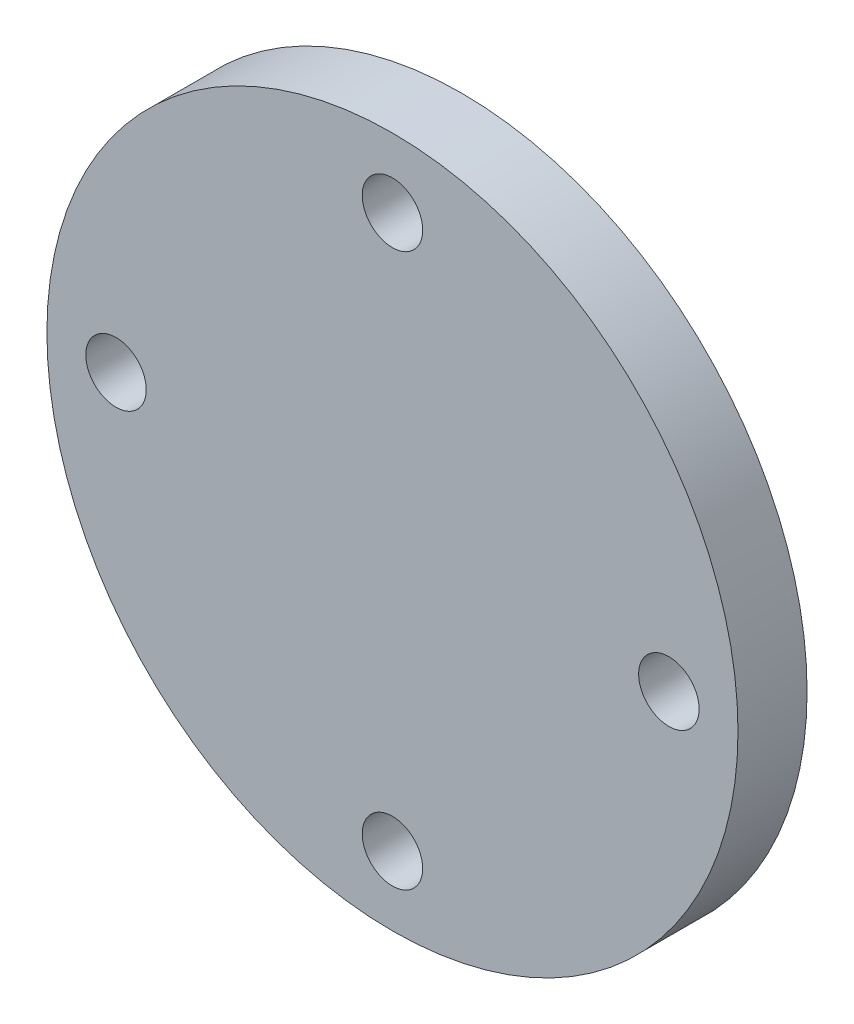
ISO-10303-21;
HEADER;
FILE_DESCRIPTION(('STEP AP214'),'2;1');
FILE_NAME('part.step','',(''),(''),'','','');
FILE_SCHEMA(('AUTOMOTIVE_DESIGN { 1 0 10303 214 1 1 1 1 }'));
ENDSEC;
DATA;
#1=APPLICATION_CONTEXT('core data for automotive mechanical design processes');
#2=APPLICATION_PROTOCOL_DEFINITION('international standard','automotive_design',2000,#1);
#3=PRODUCT_CONTEXT('',#1,'mechanical');
#4=PRODUCT('Part','Part','',(#3));
#5=PRODUCT_RELATED_PRODUCT_CATEGORY('part','',(#4));
#6=PRODUCT_DEFINITION_FORMATION('','',#4);
#7=PRODUCT_DEFINITION_CONTEXT('part definition',#1,'design');
#8=PRODUCT_DEFINITION('design','',#6,#7);
#9=PRODUCT_DEFINITION_SHAPE('','',#8);
#10=(LENGTH_UNIT() NAMED_UNIT(*) SI_UNIT(.MILLI.,.METRE.));
#11=(NAMED_UNIT(*) PLANE_ANGLE_UNIT() SI_UNIT($,.RADIAN.));
#12=(NAMED_UNIT(*) SI_UNIT($,.STERADIAN.) SOLID_ANGLE_UNIT());
#13=UNCERTAINTY_MEASURE_WITH_UNIT(LENGTH_MEASURE(1.E-05),#10,'distance_accuracy_value','');
#14=(GEOMETRIC_REPRESENTATION_CONTEXT(3) GLOBAL_UNCERTAINTY_ASSIGNED_CONTEXT((#13)) GLOBAL_UNIT_ASSIGNED_CONTEXT((#10,
#11,#12)) REPRESENTATION_CONTEXT('',''));
#15=CARTESIAN_POINT('',(0.,0.,0.));
#16=DIRECTION('',(0.,0.,1.));
#17=DIRECTION('',(1.,0.,0.));
#18=AXIS2_PLACEMENT_3D('',#15,#16,#17);
#19=CARTESIAN_POINT('',(0.,0.,0.));
#20=DIRECTION('',(0.,0.,1.));
#21=DIRECTION('',(1.,0.,0.));
#22=AXIS2_PLACEMENT_3D('',#19,#20,#21);
#23=PLANE('',#22);
#24=CARTESIAN_POINT('',(0.,0.,0.));
#25=DIRECTION('',(0.,0.,1.));
#26=DIRECTION('',(1.,0.,0.));
#27=AXIS2_PLACEMENT_3D('',#24,#25,#26);
#28=CIRCLE('',#27,63.5);
#29=CARTESIAN_POINT('',(63.5,0.,0.));
#30=VERTEX_POINT('',#29);
#31=EDGE_CURVE('E52',#30,#30,#28,.T.);
#32=ORIENTED_EDGE('',*,*,#31,.F.);
#33=EDGE_LOOP('',(#32));
#34=FACE_BOUND('',#33,.T.);
#35=CARTESIAN_POINT('',(-50.8,0.,0.));
#36=DIRECTION('',(0.,0.,1.));
#37=DIRECTION('',(1.,0.,0.));
#38=AXIS2_PLACEMENT_3D('',#35,#36,#37);
#39=CIRCLE('',#38,5.55625);
#40=CARTESIAN_POINT('',(-45.24375,0.,0.));
#41=VERTEX_POINT('',#40);
#42=EDGE_CURVE('E146',#41,#41,#39,.T.);
#43=ORIENTED_EDGE('',*,*,#42,.T.);
#44=EDGE_LOOP('',(#43));
#45=FACE_BOUND('',#44,.T.);
#46=CARTESIAN_POINT('',(1.77367252013231E-13,50.8,0.));
#47=DIRECTION('',(0.,0.,1.));
#48=DIRECTION('',(1.,0.,0.));
#49=AXIS2_PLACEMENT_3D('',#46,#47,#48);
#50=CIRCLE('',#49,5.55625);
#51=CARTESIAN_POINT('',(5.55625000000017,50.8,0.));
#52=VERTEX_POINT('',#51);
#53=EDGE_CURVE('E140',#52,#52,#50,.T.);
#54=ORIENTED_EDGE('',*,*,#53,.T.);
#55=EDGE_LOOP('',(#54));
#56=FACE_BOUND('',#55,.T.);
#57=CARTESIAN_POINT('',(50.8,-3.54734504026462E-13,0.));
#58=DIRECTION('',(0.,0.,1.));
#59=DIRECTION('',(1.,0.,0.));
#60=AXIS2_PLACEMENT_3D('',#57,#58,#59);
#61=CIRCLE('',#60,5.55625);
#62=CARTESIAN_POINT('',(56.35625,-3.54734504026462E-13,0.));
#63=VERTEX_POINT('',#62);
#64=EDGE_CURVE('E134',#63,#63,#61,.T.);
#65=ORIENTED_EDGE('',*,*,#64,.T.);
#66=EDGE_LOOP('',(#65));
#67=FACE_BOUND('',#66,.T.);
#68=CARTESIAN_POINT('',(-5.32101756039693E-13,-50.8,0.));
#69=DIRECTION('',(0.,0.,1.));
#70=DIRECTION('',(1.,0.,0.));
#71=AXIS2_PLACEMENT_3D('',#68,#69,#70);
#72=CIRCLE('',#71,5.55624999999999);
#73=CARTESIAN_POINT('',(5.55624999999946,-50.8,0.));
#74=VERTEX_POINT('',#73);
#75=EDGE_CURVE('E129',#74,#74,#72,.T.);
#76=ORIENTED_EDGE('',*,*,#75,.T.);
#77=EDGE_LOOP('',(#76));
#78=FACE_BOUND('',#77,.T.);
#79=CARTESIAN_POINT('',(0.,0.,0.));
#80=DIRECTION('',(0.,0.,-1.));
#81=DIRECTION('',(-1.,0.,0.));
#82=AXIS2_PLACEMENT_3D('',#79,#80,#81);
#83=CIRCLE('',#82,12.7);
#84=CARTESIAN_POINT('',(-12.7,0.,0.));
#85=VERTEX_POINT('',#84);
#86=EDGE_CURVE('E13',#85,#85,#83,.T.);
#87=ORIENTED_EDGE('',*,*,#86,.F.);
#88=EDGE_LOOP('',(#87));
#89=FACE_BOUND('',#88,.T.);
#90=ADVANCED_FACE('F48',(#34,#45,#56,#67,#78,#89),#23,.F.);
#91=CARTESIAN_POINT('',(0.,0.,12.7));
#92=DIRECTION('',(0.,0.,1.));
#93=DIRECTION('',(1.,0.,0.));
#94=AXIS2_PLACEMENT_3D('',#91,#92,#93);
#95=PLANE('',#94);
#96=CARTESIAN_POINT('',(50.8,-3.54734504026462E-13,12.7));
#97=DIRECTION('',(0.,0.,1.));
#98=DIRECTION('',(1.,0.,0.));
#99=AXIS2_PLACEMENT_3D('',#96,#97,#98);
#100=CIRCLE('',#99,5.55625);
#101=CARTESIAN_POINT('',(56.35625,-3.54734504026462E-13,12.7));
#102=VERTEX_POINT('',#101);
#103=EDGE_CURVE('E137',#102,#102,#100,.T.);
#104=ORIENTED_EDGE('',*,*,#103,.F.);
#105=EDGE_LOOP('',(#104));
#106=FACE_BOUND('',#105,.T.);
#107=CARTESIAN_POINT('',(-50.8,0.,12.7));
#108=DIRECTION('',(0.,0.,1.));
#109=DIRECTION('',(1.,0.,0.));
#110=AXIS2_PLACEMENT_3D('',#107,#108,#109);
#111=CIRCLE('',#110,5.55625);
#112=CARTESIAN_POINT('',(-45.24375,0.,12.7));
#113=VERTEX_POINT('',#112);
#114=EDGE_CURVE('E149',#113,#113,#111,.T.);
#115=ORIENTED_EDGE('',*,*,#114,.F.);
#116=EDGE_LOOP('',(#115));
#117=FACE_BOUND('',#116,.T.);
#118=CARTESIAN_POINT('',(0.,0.,12.7));
#119=DIRECTION('',(0.,0.,1.));
#120=DIRECTION('',(1.,0.,0.));
#121=AXIS2_PLACEMENT_3D('',#118,#119,#120);
#122=CIRCLE('',#121,63.5);
#123=CARTESIAN_POINT('',(63.5,0.,12.7));
#124=VERTEX_POINT('',#123);
#125=EDGE_CURVE('E57',#124,#124,#122,.T.);
#126=ORIENTED_EDGE('',*,*,#125,.T.);
#127=EDGE_LOOP('',(#126));
#128=FACE_BOUND('',#127,.T.);
#129=CARTESIAN_POINT('',(1.77367252013231E-13,50.8,12.7));
#130=DIRECTION('',(0.,0.,1.));
#131=DIRECTION('',(1.,0.,0.));
#132=AXIS2_PLACEMENT_3D('',#129,#130,#131);
#133=CIRCLE('',#132,5.55625);
#134=CARTESIAN_POINT('',(5.55625000000017,50.8,12.7));
#135=VERTEX_POINT('',#134);
#136=EDGE_CURVE('E143',#135,#135,#133,.T.);
#137=ORIENTED_EDGE('',*,*,#136,.F.);
#138=EDGE_LOOP('',(#137));
#139=FACE_BOUND('',#138,.T.);
#140=CARTESIAN_POINT('',(-5.32101756039693E-13,-50.8,12.7));
#141=DIRECTION('',(0.,0.,1.));
#142=DIRECTION('',(1.,0.,0.));
#143=AXIS2_PLACEMENT_3D('',#140,#141,#142);
#144=CIRCLE('',#143,5.55624999999999);
#145=CARTESIAN_POINT('',(5.55624999999946,-50.8,12.7));
#146=VERTEX_POINT('',#145);
#147=EDGE_CURVE('E131',#146,#146,#144,.T.);
#148=ORIENTED_EDGE('',*,*,#147,.F.);
#149=EDGE_LOOP('',(#148));
#150=FACE_BOUND('',#149,.T.);
#151=ADVANCED_FACE('F162',(#106,#117,#128,#139,#150),#95,.T.);
#152=CARTESIAN_POINT('',(0.,0.,12.7));
#153=DIRECTION('',(0.,0.,-1.));
#154=DIRECTION('',(-1.,0.,0.));
#155=AXIS2_PLACEMENT_3D('',#152,#153,#154);
#156=CYLINDRICAL_SURFACE('',#155,63.5);
#157=ORIENTED_EDGE('',*,*,#125,.F.);
#158=EDGE_LOOP('',(#157));
#159=FACE_BOUND('',#158,.T.);
#160=ORIENTED_EDGE('',*,*,#31,.T.);
#161=EDGE_LOOP('',(#160));
#162=FACE_BOUND('',#161,.T.);
#163=ADVANCED_FACE('F50',(#159,#162),#156,.T.);
#164=CARTESIAN_POINT('',(-50.8,0.,12.7));
#165=DIRECTION('',(0.,0.,-1.));
#166=DIRECTION('',(-1.,0.,0.));
#167=AXIS2_PLACEMENT_3D('',#164,#165,#166);
#168=CYLINDRICAL_SURFACE('',#167,5.55625);
#169=ORIENTED_EDGE('',*,*,#114,.T.);
#170=EDGE_LOOP('',(#169));
#171=FACE_BOUND('',#170,.T.);
#172=ORIENTED_EDGE('',*,*,#42,.F.);
#173=EDGE_LOOP('',(#172));
#174=FACE_BOUND('',#173,.T.);
#175=ADVANCED_FACE('F198',(#171,#174),#168,.F.);
#176=CARTESIAN_POINT('',(1.77367252013231E-13,50.8,12.7));
#177=DIRECTION('',(0.,0.,-1.));
#178=DIRECTION('',(-1.,0.,0.));
#179=AXIS2_PLACEMENT_3D('',#176,#177,#178);
#180=CYLINDRICAL_SURFACE('',#179,5.55625);
#181=ORIENTED_EDGE('',*,*,#136,.T.);
#182=EDGE_LOOP('',(#181));
#183=FACE_BOUND('',#182,.T.);
#184=ORIENTED_EDGE('',*,*,#53,.F.);
#185=EDGE_LOOP('',(#184));
#186=FACE_BOUND('',#185,.T.);
#187=ADVANCED_FACE('F194',(#183,#186),#180,.F.);
#188=CARTESIAN_POINT('',(50.8,-3.54734504026462E-13,12.7));
#189=DIRECTION('',(0.,0.,-1.));
#190=DIRECTION('',(-1.,0.,0.));
#191=AXIS2_PLACEMENT_3D('',#188,#189,#190);
#192=CYLINDRICAL_SURFACE('',#191,5.55625);
#193=ORIENTED_EDGE('',*,*,#103,.T.);
#194=EDGE_LOOP('',(#193));
#195=FACE_BOUND('',#194,.T.);
#196=ORIENTED_EDGE('',*,*,#64,.F.);
#197=EDGE_LOOP('',(#196));
#198=FACE_BOUND('',#197,.T.);
#199=ADVANCED_FACE('F190',(#195,#198),#192,.F.);
#200=CARTESIAN_POINT('',(-5.32101756039693E-13,-50.8,12.7));
#201=DIRECTION('',(0.,0.,-1.));
#202=DIRECTION('',(-1.,0.,0.));
#203=AXIS2_PLACEMENT_3D('',#200,#201,#202);
#204=CYLINDRICAL_SURFACE('',#203,5.55624999999999);
#205=ORIENTED_EDGE('',*,*,#147,.T.);
#206=EDGE_LOOP('',(#205));
#207=FACE_BOUND('',#206,.T.);
#208=ORIENTED_EDGE('',*,*,#75,.F.);
#209=EDGE_LOOP('',(#208));
#210=FACE_BOUND('',#209,.T.);
#211=ADVANCED_FACE('F183',(#207,#210),#204,.F.);
#212=CARTESIAN_POINT('',(0.,0.,-35.56));
#213=DIRECTION('',(0.,0.,-1.));
#214=DIRECTION('',(-1.,0.,0.));
#215=AXIS2_PLACEMENT_3D('',#212,#213,#214);
#216=PLANE('',#215);
#217=CARTESIAN_POINT('',(0.,0.,-35.56));
#218=DIRECTION('',(0.,0.,-1.));
#219=DIRECTION('',(-1.,0.,0.));
#220=AXIS2_PLACEMENT_3D('',#217,#218,#219);
#221=CIRCLE('',#220,12.7);
#222=CARTESIAN_POINT('',(-12.7,0.,-35.56));
#223=VERTEX_POINT('',#222);
#224=EDGE_CURVE('E106',#223,#223,#221,.T.);
#225=ORIENTED_EDGE('',*,*,#224,.T.);
#226=EDGE_LOOP('',(#225));
#227=FACE_BOUND('',#226,.T.);
#228=DIRECTION('',(0.,-1.,0.));
#229=VECTOR('',#228,1.);
#230=CARTESIAN_POINT('',(-2.413,3.1115,-35.56));
#231=LINE('',#230,#229);
#232=CARTESIAN_POINT('',(-2.413,7.56183425168788,-35.56));
#233=VERTEX_POINT('',#232);
#234=CARTESIAN_POINT('',(-2.413,3.1115,-35.56));
#235=VERTEX_POINT('',#234);
#236=EDGE_CURVE('E98',#233,#235,#231,.T.);
#237=ORIENTED_EDGE('',*,*,#236,.F.);
#238=CARTESIAN_POINT('',(0.,0.,-35.56));
#239=DIRECTION('',(0.,0.,-1.));
#240=DIRECTION('',(-1.,0.,0.));
#241=AXIS2_PLACEMENT_3D('',#238,#239,#240);
#242=CIRCLE('',#241,7.9375);
#243=CARTESIAN_POINT('',(2.413,7.56183425168788,-35.56));
#244=VERTEX_POINT('',#243);
#245=EDGE_CURVE('E90',#244,#233,#242,.T.);
#246=ORIENTED_EDGE('',*,*,#245,.F.);
#247=DIRECTION('',(0.,1.,0.));
#248=VECTOR('',#247,1.);
#249=CARTESIAN_POINT('',(2.413,7.56183425168788,-35.56));
#250=LINE('',#249,#248);
#251=CARTESIAN_POINT('',(2.413,3.1115,-35.56));
#252=VERTEX_POINT('',#251);
#253=EDGE_CURVE('E113',#252,#244,#250,.T.);
#254=ORIENTED_EDGE('',*,*,#253,.F.);
#255=DIRECTION('',(1.,0.,0.));
#256=VECTOR('',#255,1.);
#257=CARTESIAN_POINT('',(2.413,3.1115,-35.56));
#258=LINE('',#257,#256);
#259=EDGE_CURVE('E111',#235,#252,#258,.T.);
#260=ORIENTED_EDGE('',*,*,#259,.F.);
#261=EDGE_LOOP('',(#237,#246,#254,#260));
#262=FACE_BOUND('',#261,.T.);
#263=ADVANCED_FACE('F110',(#227,#262),#216,.T.);
#264=CARTESIAN_POINT('',(0.,0.,-35.56));
#265=DIRECTION('',(0.,0.,1.));
#266=DIRECTION('',(1.,0.,0.));
#267=AXIS2_PLACEMENT_3D('',#264,#265,#266);
#268=CYLINDRICAL_SURFACE('',#267,12.7);
#269=ORIENTED_EDGE('',*,*,#224,.F.);
#270=EDGE_LOOP('',(#269));
#271=FACE_BOUND('',#270,.T.);
#272=ORIENTED_EDGE('',*,*,#86,.T.);
#273=EDGE_LOOP('',(#272));
#274=FACE_BOUND('',#273,.T.);
#275=ADVANCED_FACE('F174',(#271,#274),#268,.T.);
#276=CARTESIAN_POINT('',(0.,0.,-35.56));
#277=DIRECTION('',(0.,0.,1.));
#278=DIRECTION('',(1.,0.,0.));
#279=AXIS2_PLACEMENT_3D('',#276,#277,#278);
#280=CYLINDRICAL_SURFACE('',#279,7.9375);
#281=CARTESIAN_POINT('',(0.,0.,0.));
#282=DIRECTION('',(0.,0.,-1.));
#283=DIRECTION('',(-1.,0.,0.));
#284=AXIS2_PLACEMENT_3D('',#281,#282,#283);
#285=CIRCLE('',#284,7.9375);
#286=CARTESIAN_POINT('',(2.413,7.56183425168788,0.));
#287=VERTEX_POINT('',#286);
#288=CARTESIAN_POINT('',(-2.413,7.56183425168788,0.));
#289=VERTEX_POINT('',#288);
#290=EDGE_CURVE('E117',#287,#289,#285,.T.);
#291=ORIENTED_EDGE('',*,*,#290,.F.);
#292=DIRECTION('',(0.,0.,1.));
#293=VECTOR('',#292,1.);
#294=CARTESIAN_POINT('',(2.413,7.56183425168788,-35.56));
#295=LINE('',#294,#293);
#296=EDGE_CURVE('E65',#244,#287,#295,.T.);
#297=ORIENTED_EDGE('',*,*,#296,.F.);
#298=ORIENTED_EDGE('',*,*,#245,.T.);
#299=DIRECTION('',(0.,0.,1.));
#300=VECTOR('',#299,1.);
#301=CARTESIAN_POINT('',(-2.413,7.56183425168788,-35.56));
#302=LINE('',#301,#300);
#303=EDGE_CURVE('E93',#233,#289,#302,.T.);
#304=ORIENTED_EDGE('',*,*,#303,.T.);
#305=EDGE_LOOP('',(#291,#297,#298,#304));
#306=FACE_BOUND('',#305,.T.);
#307=ADVANCED_FACE('F92',(#306),#280,.F.);
#308=CARTESIAN_POINT('',(-2.413,3.1115,-35.56));
#309=DIRECTION('',(-1.,0.,0.));
#310=DIRECTION('',(0.,0.,1.));
#311=AXIS2_PLACEMENT_3D('',#308,#309,#310);
#312=PLANE('',#311);
#313=DIRECTION('',(0.,-1.,0.));
#314=VECTOR('',#313,1.);
#315=CARTESIAN_POINT('',(-2.413,3.1115,0.));
#316=LINE('',#315,#314);
#317=CARTESIAN_POINT('',(-2.413,3.1115,0.));
#318=VERTEX_POINT('',#317);
#319=EDGE_CURVE('E105',#289,#318,#316,.T.);
#320=ORIENTED_EDGE('',*,*,#319,.F.);
#321=ORIENTED_EDGE('',*,*,#303,.F.);
#322=ORIENTED_EDGE('',*,*,#236,.T.);
#323=DIRECTION('',(0.,0.,1.));
#324=VECTOR('',#323,1.);
#325=CARTESIAN_POINT('',(-2.413,3.1115,-35.56));
#326=LINE('',#325,#324);
#327=EDGE_CURVE('E107',#235,#318,#326,.T.);
#328=ORIENTED_EDGE('',*,*,#327,.T.);
#329=EDGE_LOOP('',(#320,#321,#322,#328));
#330=FACE_BOUND('',#329,.T.);
#331=ADVANCED_FACE('F102',(#330),#312,.T.);
#332=CARTESIAN_POINT('',(2.413,3.1115,-35.56));
#333=DIRECTION('',(0.,-1.,0.));
#334=DIRECTION('',(0.,0.,-1.));
#335=AXIS2_PLACEMENT_3D('',#332,#333,#334);
#336=PLANE('',#335);
#337=DIRECTION('',(1.,0.,0.));
#338=VECTOR('',#337,1.);
#339=CARTESIAN_POINT('',(2.413,3.1115,0.));
#340=LINE('',#339,#338);
#341=CARTESIAN_POINT('',(2.413,3.1115,0.));
#342=VERTEX_POINT('',#341);
#343=EDGE_CURVE('E120',#318,#342,#340,.T.);
#344=ORIENTED_EDGE('',*,*,#343,.F.);
#345=ORIENTED_EDGE('',*,*,#327,.F.);
#346=ORIENTED_EDGE('',*,*,#259,.T.);
#347=DIRECTION('',(0.,0.,1.));
#348=VECTOR('',#347,1.);
#349=CARTESIAN_POINT('',(2.413,3.1115,-35.56));
#350=LINE('',#349,#348);
#351=EDGE_CURVE('E70',#252,#342,#350,.T.);
#352=ORIENTED_EDGE('',*,*,#351,.T.);
#353=EDGE_LOOP('',(#344,#345,#346,#352));
#354=FACE_BOUND('',#353,.T.);
#355=ADVANCED_FACE('F211',(#354),#336,.T.);
#356=CARTESIAN_POINT('',(2.413,7.56183425168788,-35.56));
#357=DIRECTION('',(1.,0.,0.));
#358=DIRECTION('',(0.,1.,0.));
#359=AXIS2_PLACEMENT_3D('',#356,#357,#358);
#360=PLANE('',#359);
#361=DIRECTION('',(0.,1.,0.));
#362=VECTOR('',#361,1.);
#363=CARTESIAN_POINT('',(2.413,7.56183425168788,0.));
#364=LINE('',#363,#362);
#365=EDGE_CURVE('E99',#342,#287,#364,.T.);
#366=ORIENTED_EDGE('',*,*,#365,.F.);
#367=ORIENTED_EDGE('',*,*,#351,.F.);
#368=ORIENTED_EDGE('',*,*,#253,.T.);
#369=ORIENTED_EDGE('',*,*,#296,.T.);
#370=EDGE_LOOP('',(#366,#367,#368,#369));
#371=FACE_BOUND('',#370,.T.);
#372=ADVANCED_FACE('F206',(#371),#360,.T.);
#373=ORIENTED_EDGE('',*,*,#365,.T.);
#374=ORIENTED_EDGE('',*,*,#290,.T.);
#375=ORIENTED_EDGE('',*,*,#319,.T.);
#376=ORIENTED_EDGE('',*,*,#343,.T.);
#377=EDGE_LOOP('',(#373,#374,#375,#376));
#378=FACE_BOUND('',#377,.T.);
#379=ADVANCED_FACE('F163',(#378),#23,.F.);
#380=CLOSED_SHELL('',(#90,#151,#163,#175,#187,#199,#211,#263,#275,#307,#331,#355,#372,#379));
#381=MANIFOLD_SOLID_BREP('B2',#380);
#382=ADVANCED_BREP_SHAPE_REPRESENTATION('',(#18,#381),#14);
#383=SHAPE_DEFINITION_REPRESENTATION(#9,#382);
ENDSEC;
END-ISO-10303-21;
